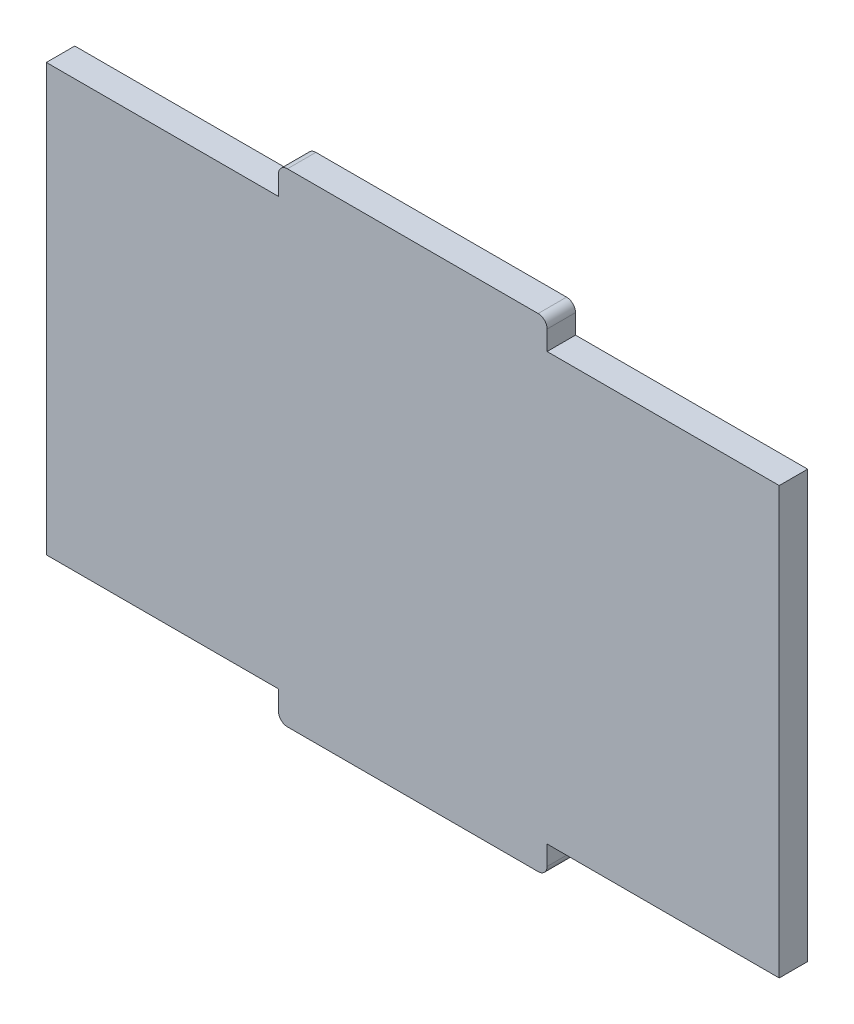
ISO-10303-21;
HEADER;
FILE_DESCRIPTION(('STEP AP214'),'2;1');
FILE_NAME('part.step','',(''),(''),'','','');
FILE_SCHEMA(('AUTOMOTIVE_DESIGN { 1 0 10303 214 1 1 1 1 }'));
ENDSEC;
DATA;
#1=APPLICATION_CONTEXT('core data for automotive mechanical design processes');
#2=APPLICATION_PROTOCOL_DEFINITION('international standard','automotive_design',2000,#1);
#3=PRODUCT_CONTEXT('',#1,'mechanical');
#4=PRODUCT('Part','Part','',(#3));
#5=PRODUCT_RELATED_PRODUCT_CATEGORY('part','',(#4));
#6=PRODUCT_DEFINITION_FORMATION('','',#4);
#7=PRODUCT_DEFINITION_CONTEXT('part definition',#1,'design');
#8=PRODUCT_DEFINITION('design','',#6,#7);
#9=PRODUCT_DEFINITION_SHAPE('','',#8);
#10=(LENGTH_UNIT() NAMED_UNIT(*) SI_UNIT(.MILLI.,.METRE.));
#11=(NAMED_UNIT(*) PLANE_ANGLE_UNIT() SI_UNIT($,.RADIAN.));
#12=(NAMED_UNIT(*) SI_UNIT($,.STERADIAN.) SOLID_ANGLE_UNIT());
#13=UNCERTAINTY_MEASURE_WITH_UNIT(LENGTH_MEASURE(1.E-05),#10,'distance_accuracy_value','');
#14=(GEOMETRIC_REPRESENTATION_CONTEXT(3) GLOBAL_UNCERTAINTY_ASSIGNED_CONTEXT((#13)) GLOBAL_UNIT_ASSIGNED_CONTEXT((#10,
#11,#12)) REPRESENTATION_CONTEXT('',''));
#15=CARTESIAN_POINT('',(0.,0.,0.));
#16=DIRECTION('',(0.,0.,1.));
#17=DIRECTION('',(1.,0.,0.));
#18=AXIS2_PLACEMENT_3D('',#15,#16,#17);
#19=CARTESIAN_POINT('',(-40.925,-23.815,3.175));
#20=DIRECTION('',(-1.,0.,0.));
#21=DIRECTION('',(0.,0.,1.));
#22=AXIS2_PLACEMENT_3D('',#19,#20,#21);
#23=PLANE('',#22);
#24=DIRECTION('',(0.,1.,0.));
#25=VECTOR('',#24,1.);
#26=CARTESIAN_POINT('',(-40.925,-23.815,0.));
#27=LINE('',#26,#25);
#28=CARTESIAN_POINT('',(-40.925,-23.815,0.));
#29=VERTEX_POINT('',#28);
#30=CARTESIAN_POINT('',(-40.925,23.815,0.));
#31=VERTEX_POINT('',#30);
#32=EDGE_CURVE('E220',#29,#31,#27,.T.);
#33=ORIENTED_EDGE('',*,*,#32,.F.);
#34=DIRECTION('',(0.,0.,-1.));
#35=VECTOR('',#34,1.);
#36=CARTESIAN_POINT('',(-40.925,-23.815,3.175));
#37=LINE('',#36,#35);
#38=CARTESIAN_POINT('',(-40.925,-23.815,3.175));
#39=VERTEX_POINT('',#38);
#40=EDGE_CURVE('E181',#39,#29,#37,.T.);
#41=ORIENTED_EDGE('',*,*,#40,.F.);
#42=DIRECTION('',(0.,1.,0.));
#43=VECTOR('',#42,1.);
#44=CARTESIAN_POINT('',(-40.925,-23.815,3.175));
#45=LINE('',#44,#43);
#46=CARTESIAN_POINT('',(-40.925,23.815,3.175));
#47=VERTEX_POINT('',#46);
#48=EDGE_CURVE('E177',#39,#47,#45,.T.);
#49=ORIENTED_EDGE('',*,*,#48,.T.);
#50=DIRECTION('',(0.,0.,-1.));
#51=VECTOR('',#50,1.);
#52=CARTESIAN_POINT('',(-40.925,23.815,3.175));
#53=LINE('',#52,#51);
#54=EDGE_CURVE('E159',#47,#31,#53,.T.);
#55=ORIENTED_EDGE('',*,*,#54,.T.);
#56=EDGE_LOOP('',(#33,#41,#49,#55));
#57=FACE_BOUND('',#56,.T.);
#58=ADVANCED_FACE('F44',(#57),#23,.T.);
#59=CARTESIAN_POINT('',(-40.925,-23.815,3.175));
#60=DIRECTION('',(0.,1.,0.));
#61=DIRECTION('',(-1.,0.,0.));
#62=AXIS2_PLACEMENT_3D('',#59,#60,#61);
#63=PLANE('',#62);
#64=DIRECTION('',(1.,0.,0.));
#65=VECTOR('',#64,1.);
#66=CARTESIAN_POINT('',(-40.925,-23.815,0.));
#67=LINE('',#66,#65);
#68=CARTESIAN_POINT('',(-15.,-23.815,0.));
#69=VERTEX_POINT('',#68);
#70=EDGE_CURVE('E184',#29,#69,#67,.T.);
#71=ORIENTED_EDGE('',*,*,#70,.T.);
#72=DIRECTION('',(0.,0.,-1.));
#73=VECTOR('',#72,1.);
#74=CARTESIAN_POINT('',(-15.,-23.815,3.175));
#75=LINE('',#74,#73);
#76=CARTESIAN_POINT('',(-15.,-23.815,3.175));
#77=VERTEX_POINT('',#76);
#78=EDGE_CURVE('E260',#77,#69,#75,.T.);
#79=ORIENTED_EDGE('',*,*,#78,.F.);
#80=DIRECTION('',(1.,0.,0.));
#81=VECTOR('',#80,1.);
#82=CARTESIAN_POINT('',(-40.925,-23.815,3.175));
#83=LINE('',#82,#81);
#84=EDGE_CURVE('E171',#39,#77,#83,.T.);
#85=ORIENTED_EDGE('',*,*,#84,.F.);
#86=ORIENTED_EDGE('',*,*,#40,.T.);
#87=EDGE_LOOP('',(#71,#79,#85,#86));
#88=FACE_BOUND('',#87,.T.);
#89=ADVANCED_FACE('F341',(#88),#63,.F.);
#90=CARTESIAN_POINT('',(-15.,-26.99,3.175));
#91=DIRECTION('',(-1.,0.,0.));
#92=DIRECTION('',(0.,0.,1.));
#93=AXIS2_PLACEMENT_3D('',#90,#91,#92);
#94=PLANE('',#93);
#95=DIRECTION('',(0.,1.,0.));
#96=VECTOR('',#95,1.);
#97=CARTESIAN_POINT('',(-15.,-26.99,0.));
#98=LINE('',#97,#96);
#99=CARTESIAN_POINT('',(-15.,-25.99,0.));
#100=VERTEX_POINT('',#99);
#101=EDGE_CURVE('E188',#100,#69,#98,.T.);
#102=ORIENTED_EDGE('',*,*,#101,.F.);
#103=DIRECTION('',(0.,0.,-1.));
#104=VECTOR('',#103,1.);
#105=CARTESIAN_POINT('',(-15.,-25.99,3.175));
#106=LINE('',#105,#104);
#107=CARTESIAN_POINT('',(-15.,-25.99,3.175));
#108=VERTEX_POINT('',#107);
#109=EDGE_CURVE('E312',#100,#108,#106,.F.);
#110=ORIENTED_EDGE('',*,*,#109,.T.);
#111=DIRECTION('',(0.,1.,0.));
#112=VECTOR('',#111,1.);
#113=CARTESIAN_POINT('',(-15.,-26.99,3.175));
#114=LINE('',#113,#112);
#115=EDGE_CURVE('E215',#108,#77,#114,.T.);
#116=ORIENTED_EDGE('',*,*,#115,.T.);
#117=ORIENTED_EDGE('',*,*,#78,.T.);
#118=EDGE_LOOP('',(#102,#110,#116,#117));
#119=FACE_BOUND('',#118,.T.);
#120=ADVANCED_FACE('F396',(#119),#94,.T.);
#121=CARTESIAN_POINT('',(-15.,-26.99,3.175));
#122=DIRECTION('',(0.,1.,0.));
#123=DIRECTION('',(0.,0.,1.));
#124=AXIS2_PLACEMENT_3D('',#121,#122,#123);
#125=PLANE('',#124);
#126=DIRECTION('',(1.,0.,0.));
#127=VECTOR('',#126,1.);
#128=CARTESIAN_POINT('',(-15.,-26.99,0.));
#129=LINE('',#128,#127);
#130=CARTESIAN_POINT('',(-14.,-26.99,0.));
#131=VERTEX_POINT('',#130);
#132=CARTESIAN_POINT('',(14.,-26.99,0.));
#133=VERTEX_POINT('',#132);
#134=EDGE_CURVE('E251',#131,#133,#129,.T.);
#135=ORIENTED_EDGE('',*,*,#134,.T.);
#136=DIRECTION('',(0.,0.,-1.));
#137=VECTOR('',#136,1.);
#138=CARTESIAN_POINT('',(14.,-26.99,3.175));
#139=LINE('',#138,#137);
#140=CARTESIAN_POINT('',(14.,-26.99,3.175));
#141=VERTEX_POINT('',#140);
#142=EDGE_CURVE('E299',#133,#141,#139,.F.);
#143=ORIENTED_EDGE('',*,*,#142,.T.);
#144=DIRECTION('',(1.,0.,0.));
#145=VECTOR('',#144,1.);
#146=CARTESIAN_POINT('',(-15.,-26.99,3.175));
#147=LINE('',#146,#145);
#148=CARTESIAN_POINT('',(-14.,-26.99,3.175));
#149=VERTEX_POINT('',#148);
#150=EDGE_CURVE('E212',#149,#141,#147,.T.);
#151=ORIENTED_EDGE('',*,*,#150,.F.);
#152=DIRECTION('',(0.,0.,-1.));
#153=VECTOR('',#152,1.);
#154=CARTESIAN_POINT('',(-14.,-26.99,0.));
#155=LINE('',#154,#153);
#156=EDGE_CURVE('E295',#149,#131,#155,.T.);
#157=ORIENTED_EDGE('',*,*,#156,.T.);
#158=EDGE_LOOP('',(#135,#143,#151,#157));
#159=FACE_BOUND('',#158,.T.);
#160=ADVANCED_FACE('F352',(#159),#125,.F.);
#161=CARTESIAN_POINT('',(15.,-26.99,3.175));
#162=DIRECTION('',(-1.,0.,0.));
#163=DIRECTION('',(0.,0.,1.));
#164=AXIS2_PLACEMENT_3D('',#161,#162,#163);
#165=PLANE('',#164);
#166=DIRECTION('',(0.,1.,0.));
#167=VECTOR('',#166,1.);
#168=CARTESIAN_POINT('',(15.,-26.99,3.175));
#169=LINE('',#168,#167);
#170=CARTESIAN_POINT('',(15.,-25.99,3.175));
#171=VERTEX_POINT('',#170);
#172=CARTESIAN_POINT('',(15.,-23.815,3.175));
#173=VERTEX_POINT('',#172);
#174=EDGE_CURVE('E209',#171,#173,#169,.T.);
#175=ORIENTED_EDGE('',*,*,#174,.F.);
#176=DIRECTION('',(0.,0.,-1.));
#177=VECTOR('',#176,1.);
#178=CARTESIAN_POINT('',(15.,-25.99,3.175));
#179=LINE('',#178,#177);
#180=CARTESIAN_POINT('',(15.,-25.99,0.));
#181=VERTEX_POINT('',#180);
#182=EDGE_CURVE('E259',#171,#181,#179,.T.);
#183=ORIENTED_EDGE('',*,*,#182,.T.);
#184=DIRECTION('',(0.,1.,0.));
#185=VECTOR('',#184,1.);
#186=CARTESIAN_POINT('',(15.,-26.99,0.));
#187=LINE('',#186,#185);
#188=CARTESIAN_POINT('',(15.,-23.815,0.));
#189=VERTEX_POINT('',#188);
#190=EDGE_CURVE('E248',#181,#189,#187,.T.);
#191=ORIENTED_EDGE('',*,*,#190,.T.);
#192=DIRECTION('',(0.,0.,-1.));
#193=VECTOR('',#192,1.);
#194=CARTESIAN_POINT('',(15.,-23.815,3.175));
#195=LINE('',#194,#193);
#196=EDGE_CURVE('E264',#173,#189,#195,.T.);
#197=ORIENTED_EDGE('',*,*,#196,.F.);
#198=EDGE_LOOP('',(#175,#183,#191,#197));
#199=FACE_BOUND('',#198,.T.);
#200=ADVANCED_FACE('F361',(#199),#165,.F.);
#201=CARTESIAN_POINT('',(15.,-23.815,3.175));
#202=DIRECTION('',(0.,1.,0.));
#203=DIRECTION('',(-1.,0.,0.));
#204=AXIS2_PLACEMENT_3D('',#201,#202,#203);
#205=PLANE('',#204);
#206=DIRECTION('',(1.,0.,0.));
#207=VECTOR('',#206,1.);
#208=CARTESIAN_POINT('',(15.,-23.815,0.));
#209=LINE('',#208,#207);
#210=CARTESIAN_POINT('',(40.925,-23.815,0.));
#211=VERTEX_POINT('',#210);
#212=EDGE_CURVE('E245',#189,#211,#209,.T.);
#213=ORIENTED_EDGE('',*,*,#212,.T.);
#214=DIRECTION('',(0.,0.,-1.));
#215=VECTOR('',#214,1.);
#216=CARTESIAN_POINT('',(40.925,-23.815,3.175));
#217=LINE('',#216,#215);
#218=CARTESIAN_POINT('',(40.925,-23.815,3.175));
#219=VERTEX_POINT('',#218);
#220=EDGE_CURVE('E268',#219,#211,#217,.T.);
#221=ORIENTED_EDGE('',*,*,#220,.F.);
#222=DIRECTION('',(1.,0.,0.));
#223=VECTOR('',#222,1.);
#224=CARTESIAN_POINT('',(15.,-23.815,3.175));
#225=LINE('',#224,#223);
#226=EDGE_CURVE('E206',#173,#219,#225,.T.);
#227=ORIENTED_EDGE('',*,*,#226,.F.);
#228=ORIENTED_EDGE('',*,*,#196,.T.);
#229=EDGE_LOOP('',(#213,#221,#227,#228));
#230=FACE_BOUND('',#229,.T.);
#231=ADVANCED_FACE('F369',(#230),#205,.F.);
#232=CARTESIAN_POINT('',(40.925,-23.815,3.175));
#233=DIRECTION('',(-1.,0.,0.));
#234=DIRECTION('',(0.,0.,1.));
#235=AXIS2_PLACEMENT_3D('',#232,#233,#234);
#236=PLANE('',#235);
#237=DIRECTION('',(0.,1.,0.));
#238=VECTOR('',#237,1.);
#239=CARTESIAN_POINT('',(40.925,-23.815,0.));
#240=LINE('',#239,#238);
#241=CARTESIAN_POINT('',(40.925,23.815,0.));
#242=VERTEX_POINT('',#241);
#243=EDGE_CURVE('E241',#211,#242,#240,.T.);
#244=ORIENTED_EDGE('',*,*,#243,.T.);
#245=DIRECTION('',(0.,0.,-1.));
#246=VECTOR('',#245,1.);
#247=CARTESIAN_POINT('',(40.925,23.815,3.175));
#248=LINE('',#247,#246);
#249=CARTESIAN_POINT('',(40.925,23.815,3.175));
#250=VERTEX_POINT('',#249);
#251=EDGE_CURVE('E272',#250,#242,#248,.T.);
#252=ORIENTED_EDGE('',*,*,#251,.F.);
#253=DIRECTION('',(0.,1.,0.));
#254=VECTOR('',#253,1.);
#255=CARTESIAN_POINT('',(40.925,-23.815,3.175));
#256=LINE('',#255,#254);
#257=EDGE_CURVE('E203',#219,#250,#256,.T.);
#258=ORIENTED_EDGE('',*,*,#257,.F.);
#259=ORIENTED_EDGE('',*,*,#220,.T.);
#260=EDGE_LOOP('',(#244,#252,#258,#259));
#261=FACE_BOUND('',#260,.T.);
#262=ADVANCED_FACE('F372',(#261),#236,.F.);
#263=CARTESIAN_POINT('',(15.,23.815,3.175));
#264=DIRECTION('',(0.,1.,0.));
#265=DIRECTION('',(-1.,0.,0.));
#266=AXIS2_PLACEMENT_3D('',#263,#264,#265);
#267=PLANE('',#266);
#268=DIRECTION('',(1.,0.,0.));
#269=VECTOR('',#268,1.);
#270=CARTESIAN_POINT('',(15.,23.815,0.));
#271=LINE('',#270,#269);
#272=CARTESIAN_POINT('',(15.,23.815,0.));
#273=VERTEX_POINT('',#272);
#274=EDGE_CURVE('E237',#273,#242,#271,.T.);
#275=ORIENTED_EDGE('',*,*,#274,.F.);
#276=DIRECTION('',(0.,0.,-1.));
#277=VECTOR('',#276,1.);
#278=CARTESIAN_POINT('',(15.,23.815,3.175));
#279=LINE('',#278,#277);
#280=CARTESIAN_POINT('',(15.,23.815,3.175));
#281=VERTEX_POINT('',#280);
#282=EDGE_CURVE('E275',#281,#273,#279,.T.);
#283=ORIENTED_EDGE('',*,*,#282,.F.);
#284=DIRECTION('',(1.,0.,0.));
#285=VECTOR('',#284,1.);
#286=CARTESIAN_POINT('',(15.,23.815,3.175));
#287=LINE('',#286,#285);
#288=EDGE_CURVE('E199',#281,#250,#287,.T.);
#289=ORIENTED_EDGE('',*,*,#288,.T.);
#290=ORIENTED_EDGE('',*,*,#251,.T.);
#291=EDGE_LOOP('',(#275,#283,#289,#290));
#292=FACE_BOUND('',#291,.T.);
#293=ADVANCED_FACE('F375',(#292),#267,.T.);
#294=CARTESIAN_POINT('',(15.,23.815,3.175));
#295=DIRECTION('',(-1.,0.,0.));
#296=DIRECTION('',(0.,0.,1.));
#297=AXIS2_PLACEMENT_3D('',#294,#295,#296);
#298=PLANE('',#297);
#299=DIRECTION('',(0.,1.,0.));
#300=VECTOR('',#299,1.);
#301=CARTESIAN_POINT('',(15.,23.815,0.));
#302=LINE('',#301,#300);
#303=CARTESIAN_POINT('',(15.,25.99,0.));
#304=VERTEX_POINT('',#303);
#305=EDGE_CURVE('E233',#273,#304,#302,.T.);
#306=ORIENTED_EDGE('',*,*,#305,.T.);
#307=DIRECTION('',(0.,0.,-1.));
#308=VECTOR('',#307,1.);
#309=CARTESIAN_POINT('',(15.,25.99,3.175));
#310=LINE('',#309,#308);
#311=CARTESIAN_POINT('',(15.,25.99,3.175));
#312=VERTEX_POINT('',#311);
#313=EDGE_CURVE('E11',#304,#312,#310,.F.);
#314=ORIENTED_EDGE('',*,*,#313,.T.);
#315=DIRECTION('',(0.,1.,0.));
#316=VECTOR('',#315,1.);
#317=CARTESIAN_POINT('',(15.,23.815,3.175));
#318=LINE('',#317,#316);
#319=EDGE_CURVE('E196',#281,#312,#318,.T.);
#320=ORIENTED_EDGE('',*,*,#319,.F.);
#321=ORIENTED_EDGE('',*,*,#282,.T.);
#322=EDGE_LOOP('',(#306,#314,#320,#321));
#323=FACE_BOUND('',#322,.T.);
#324=ADVANCED_FACE('F381',(#323),#298,.F.);
#325=CARTESIAN_POINT('',(-15.,26.99,3.175));
#326=DIRECTION('',(0.,1.,0.));
#327=DIRECTION('',(0.,0.,1.));
#328=AXIS2_PLACEMENT_3D('',#325,#326,#327);
#329=PLANE('',#328);
#330=DIRECTION('',(1.,0.,0.));
#331=VECTOR('',#330,1.);
#332=CARTESIAN_POINT('',(-15.,26.99,0.));
#333=LINE('',#332,#331);
#334=CARTESIAN_POINT('',(-14.,26.99,0.));
#335=VERTEX_POINT('',#334);
#336=CARTESIAN_POINT('',(14.,26.99,0.));
#337=VERTEX_POINT('',#336);
#338=EDGE_CURVE('E229',#335,#337,#333,.T.);
#339=ORIENTED_EDGE('',*,*,#338,.F.);
#340=DIRECTION('',(0.,0.,-1.));
#341=VECTOR('',#340,1.);
#342=CARTESIAN_POINT('',(-14.,26.99,3.175));
#343=LINE('',#342,#341);
#344=CARTESIAN_POINT('',(-14.,26.99,3.175));
#345=VERTEX_POINT('',#344);
#346=EDGE_CURVE('E53',#335,#345,#343,.F.);
#347=ORIENTED_EDGE('',*,*,#346,.T.);
#348=DIRECTION('',(1.,0.,0.));
#349=VECTOR('',#348,1.);
#350=CARTESIAN_POINT('',(-15.,26.99,3.175));
#351=LINE('',#350,#349);
#352=CARTESIAN_POINT('',(14.,26.99,3.175));
#353=VERTEX_POINT('',#352);
#354=EDGE_CURVE('E193',#345,#353,#351,.T.);
#355=ORIENTED_EDGE('',*,*,#354,.T.);
#356=DIRECTION('',(0.,0.,-1.));
#357=VECTOR('',#356,1.);
#358=CARTESIAN_POINT('',(14.,26.99,0.));
#359=LINE('',#358,#357);
#360=EDGE_CURVE('E319',#353,#337,#359,.T.);
#361=ORIENTED_EDGE('',*,*,#360,.T.);
#362=EDGE_LOOP('',(#339,#347,#355,#361));
#363=FACE_BOUND('',#362,.T.);
#364=ADVANCED_FACE('F326',(#363),#329,.T.);
#365=CARTESIAN_POINT('',(-15.,23.815,3.175));
#366=DIRECTION('',(-1.,0.,0.));
#367=DIRECTION('',(0.,0.,1.));
#368=AXIS2_PLACEMENT_3D('',#365,#366,#367);
#369=PLANE('',#368);
#370=DIRECTION('',(0.,1.,0.));
#371=VECTOR('',#370,1.);
#372=CARTESIAN_POINT('',(-15.,23.815,3.175));
#373=LINE('',#372,#371);
#374=CARTESIAN_POINT('',(-15.,23.815,3.175));
#375=VERTEX_POINT('',#374);
#376=CARTESIAN_POINT('',(-15.,25.99,3.175));
#377=VERTEX_POINT('',#376);
#378=EDGE_CURVE('E178',#375,#377,#373,.T.);
#379=ORIENTED_EDGE('',*,*,#378,.T.);
#380=DIRECTION('',(0.,0.,-1.));
#381=VECTOR('',#380,1.);
#382=CARTESIAN_POINT('',(-15.,25.99,3.175));
#383=LINE('',#382,#381);
#384=CARTESIAN_POINT('',(-15.,25.99,0.));
#385=VERTEX_POINT('',#384);
#386=EDGE_CURVE('E315',#377,#385,#383,.T.);
#387=ORIENTED_EDGE('',*,*,#386,.T.);
#388=DIRECTION('',(0.,1.,0.));
#389=VECTOR('',#388,1.);
#390=CARTESIAN_POINT('',(-15.,23.815,0.));
#391=LINE('',#390,#389);
#392=CARTESIAN_POINT('',(-15.,23.815,0.));
#393=VERTEX_POINT('',#392);
#394=EDGE_CURVE('E225',#393,#385,#391,.T.);
#395=ORIENTED_EDGE('',*,*,#394,.F.);
#396=DIRECTION('',(0.,0.,-1.));
#397=VECTOR('',#396,1.);
#398=CARTESIAN_POINT('',(-15.,23.815,3.175));
#399=LINE('',#398,#397);
#400=EDGE_CURVE('E170',#375,#393,#399,.T.);
#401=ORIENTED_EDGE('',*,*,#400,.F.);
#402=EDGE_LOOP('',(#379,#387,#395,#401));
#403=FACE_BOUND('',#402,.T.);
#404=ADVANCED_FACE('F333',(#403),#369,.T.);
#405=CARTESIAN_POINT('',(-40.925,23.815,3.175));
#406=DIRECTION('',(0.,1.,0.));
#407=DIRECTION('',(-1.,0.,0.));
#408=AXIS2_PLACEMENT_3D('',#405,#406,#407);
#409=PLANE('',#408);
#410=DIRECTION('',(1.,0.,0.));
#411=VECTOR('',#410,1.);
#412=CARTESIAN_POINT('',(-40.925,23.815,0.));
#413=LINE('',#412,#411);
#414=EDGE_CURVE('E164',#31,#393,#413,.T.);
#415=ORIENTED_EDGE('',*,*,#414,.F.);
#416=ORIENTED_EDGE('',*,*,#54,.F.);
#417=DIRECTION('',(1.,0.,0.));
#418=VECTOR('',#417,1.);
#419=CARTESIAN_POINT('',(-40.925,23.815,3.175));
#420=LINE('',#419,#418);
#421=EDGE_CURVE('E162',#47,#375,#420,.T.);
#422=ORIENTED_EDGE('',*,*,#421,.T.);
#423=ORIENTED_EDGE('',*,*,#400,.T.);
#424=EDGE_LOOP('',(#415,#416,#422,#423));
#425=FACE_BOUND('',#424,.T.);
#426=ADVANCED_FACE('F161',(#425),#409,.T.);
#427=CARTESIAN_POINT('',(0.,0.,3.175));
#428=DIRECTION('',(0.,0.,-1.));
#429=DIRECTION('',(-1.,0.,0.));
#430=AXIS2_PLACEMENT_3D('',#427,#428,#429);
#431=PLANE('',#430);
#432=ORIENTED_EDGE('',*,*,#150,.T.);
#433=CARTESIAN_POINT('',(14.,-25.99,3.175));
#434=DIRECTION('',(0.,0.,-1.));
#435=DIRECTION('',(-1.,0.,0.));
#436=AXIS2_PLACEMENT_3D('',#433,#434,#435);
#437=CIRCLE('',#436,1.);
#438=EDGE_CURVE('E309',#141,#171,#437,.F.);
#439=ORIENTED_EDGE('',*,*,#438,.T.);
#440=ORIENTED_EDGE('',*,*,#174,.T.);
#441=ORIENTED_EDGE('',*,*,#226,.T.);
#442=ORIENTED_EDGE('',*,*,#257,.T.);
#443=ORIENTED_EDGE('',*,*,#288,.F.);
#444=ORIENTED_EDGE('',*,*,#319,.T.);
#445=CARTESIAN_POINT('',(14.,25.99,3.175));
#446=DIRECTION('',(0.,0.,-1.));
#447=DIRECTION('',(-1.,0.,0.));
#448=AXIS2_PLACEMENT_3D('',#445,#446,#447);
#449=CIRCLE('',#448,1.);
#450=EDGE_CURVE('E66',#312,#353,#449,.F.);
#451=ORIENTED_EDGE('',*,*,#450,.T.);
#452=ORIENTED_EDGE('',*,*,#354,.F.);
#453=CARTESIAN_POINT('',(-14.,25.99,3.175));
#454=DIRECTION('',(0.,0.,-1.));
#455=DIRECTION('',(-1.,0.,0.));
#456=AXIS2_PLACEMENT_3D('',#453,#454,#455);
#457=CIRCLE('',#456,1.);
#458=EDGE_CURVE('E60',#345,#377,#457,.F.);
#459=ORIENTED_EDGE('',*,*,#458,.T.);
#460=ORIENTED_EDGE('',*,*,#378,.F.);
#461=ORIENTED_EDGE('',*,*,#421,.F.);
#462=ORIENTED_EDGE('',*,*,#48,.F.);
#463=ORIENTED_EDGE('',*,*,#84,.T.);
#464=ORIENTED_EDGE('',*,*,#115,.F.);
#465=CARTESIAN_POINT('',(-14.,-25.99,3.175));
#466=DIRECTION('',(0.,0.,-1.));
#467=DIRECTION('',(-1.,0.,0.));
#468=AXIS2_PLACEMENT_3D('',#465,#466,#467);
#469=CIRCLE('',#468,1.);
#470=EDGE_CURVE('E306',#108,#149,#469,.F.);
#471=ORIENTED_EDGE('',*,*,#470,.T.);
#472=EDGE_LOOP('',(#432,#439,#440,#441,#442,#443,#444,#451,#452,#459,#460,#461,#462,#463,#464,#471));
#473=FACE_BOUND('',#472,.T.);
#474=ADVANCED_FACE('F175',(#473),#431,.F.);
#475=CARTESIAN_POINT('',(0.,0.,0.));
#476=DIRECTION('',(0.,0.,-1.));
#477=DIRECTION('',(-1.,0.,0.));
#478=AXIS2_PLACEMENT_3D('',#475,#476,#477);
#479=PLANE('',#478);
#480=ORIENTED_EDGE('',*,*,#190,.F.);
#481=CARTESIAN_POINT('',(14.,-25.99,0.));
#482=DIRECTION('',(0.,0.,-1.));
#483=DIRECTION('',(-1.,0.,0.));
#484=AXIS2_PLACEMENT_3D('',#481,#482,#483);
#485=CIRCLE('',#484,1.);
#486=EDGE_CURVE('E292',#181,#133,#485,.T.);
#487=ORIENTED_EDGE('',*,*,#486,.T.);
#488=ORIENTED_EDGE('',*,*,#134,.F.);
#489=CARTESIAN_POINT('',(-14.,-25.99,0.));
#490=DIRECTION('',(0.,0.,-1.));
#491=DIRECTION('',(-1.,0.,0.));
#492=AXIS2_PLACEMENT_3D('',#489,#490,#491);
#493=CIRCLE('',#492,1.);
#494=EDGE_CURVE('E289',#131,#100,#493,.T.);
#495=ORIENTED_EDGE('',*,*,#494,.T.);
#496=ORIENTED_EDGE('',*,*,#101,.T.);
#497=ORIENTED_EDGE('',*,*,#70,.F.);
#498=ORIENTED_EDGE('',*,*,#32,.T.);
#499=ORIENTED_EDGE('',*,*,#414,.T.);
#500=ORIENTED_EDGE('',*,*,#394,.T.);
#501=CARTESIAN_POINT('',(-14.,25.99,0.));
#502=DIRECTION('',(0.,0.,-1.));
#503=DIRECTION('',(-1.,0.,0.));
#504=AXIS2_PLACEMENT_3D('',#501,#502,#503);
#505=CIRCLE('',#504,1.);
#506=EDGE_CURVE('E286',#385,#335,#505,.T.);
#507=ORIENTED_EDGE('',*,*,#506,.T.);
#508=ORIENTED_EDGE('',*,*,#338,.T.);
#509=CARTESIAN_POINT('',(14.,25.99,0.));
#510=DIRECTION('',(0.,0.,-1.));
#511=DIRECTION('',(-1.,0.,0.));
#512=AXIS2_PLACEMENT_3D('',#509,#510,#511);
#513=CIRCLE('',#512,1.);
#514=EDGE_CURVE('E283',#337,#304,#513,.T.);
#515=ORIENTED_EDGE('',*,*,#514,.T.);
#516=ORIENTED_EDGE('',*,*,#305,.F.);
#517=ORIENTED_EDGE('',*,*,#274,.T.);
#518=ORIENTED_EDGE('',*,*,#243,.F.);
#519=ORIENTED_EDGE('',*,*,#212,.F.);
#520=EDGE_LOOP('',(#480,#487,#488,#495,#496,#497,#498,#499,#500,#507,#508,#515,#516,#517,#518,#519));
#521=FACE_BOUND('',#520,.T.);
#522=ADVANCED_FACE('F336',(#521),#479,.T.);
#523=CARTESIAN_POINT('',(14.,-25.99,3.175));
#524=DIRECTION('',(0.,0.,-1.));
#525=DIRECTION('',(-1.,0.,0.));
#526=AXIS2_PLACEMENT_3D('',#523,#524,#525);
#527=CYLINDRICAL_SURFACE('',#526,1.);
#528=ORIENTED_EDGE('',*,*,#438,.F.);
#529=ORIENTED_EDGE('',*,*,#142,.F.);
#530=ORIENTED_EDGE('',*,*,#486,.F.);
#531=ORIENTED_EDGE('',*,*,#182,.F.);
#532=EDGE_LOOP('',(#528,#529,#530,#531));
#533=FACE_BOUND('',#532,.T.);
#534=ADVANCED_FACE('F358',(#533),#527,.T.);
#535=CARTESIAN_POINT('',(-14.,-25.99,3.175));
#536=DIRECTION('',(0.,0.,1.));
#537=DIRECTION('',(1.,0.,0.));
#538=AXIS2_PLACEMENT_3D('',#535,#536,#537);
#539=CYLINDRICAL_SURFACE('',#538,1.);
#540=ORIENTED_EDGE('',*,*,#470,.F.);
#541=ORIENTED_EDGE('',*,*,#109,.F.);
#542=ORIENTED_EDGE('',*,*,#494,.F.);
#543=ORIENTED_EDGE('',*,*,#156,.F.);
#544=EDGE_LOOP('',(#540,#541,#542,#543));
#545=FACE_BOUND('',#544,.T.);
#546=ADVANCED_FACE('F349',(#545),#539,.T.);
#547=CARTESIAN_POINT('',(-14.,25.99,3.175));
#548=DIRECTION('',(0.,0.,-1.));
#549=DIRECTION('',(-1.,0.,0.));
#550=AXIS2_PLACEMENT_3D('',#547,#548,#549);
#551=CYLINDRICAL_SURFACE('',#550,1.);
#552=ORIENTED_EDGE('',*,*,#458,.F.);
#553=ORIENTED_EDGE('',*,*,#346,.F.);
#554=ORIENTED_EDGE('',*,*,#506,.F.);
#555=ORIENTED_EDGE('',*,*,#386,.F.);
#556=EDGE_LOOP('',(#552,#553,#554,#555));
#557=FACE_BOUND('',#556,.T.);
#558=ADVANCED_FACE('F330',(#557),#551,.T.);
#559=CARTESIAN_POINT('',(14.,25.99,3.175));
#560=DIRECTION('',(0.,0.,1.));
#561=DIRECTION('',(1.,0.,0.));
#562=AXIS2_PLACEMENT_3D('',#559,#560,#561);
#563=CYLINDRICAL_SURFACE('',#562,1.);
#564=ORIENTED_EDGE('',*,*,#450,.F.);
#565=ORIENTED_EDGE('',*,*,#313,.F.);
#566=ORIENTED_EDGE('',*,*,#514,.F.);
#567=ORIENTED_EDGE('',*,*,#360,.F.);
#568=EDGE_LOOP('',(#564,#565,#566,#567));
#569=FACE_BOUND('',#568,.T.);
#570=ADVANCED_FACE('F46',(#569),#563,.T.);
#571=CLOSED_SHELL('',(#58,#89,#120,#160,#200,#231,#262,#293,#324,#364,#404,#426,#474,#522,#534,
#546,#558,#570));
#572=MANIFOLD_SOLID_BREP('B2',#571);
#573=ADVANCED_BREP_SHAPE_REPRESENTATION('',(#18,#572),#14);
#574=SHAPE_DEFINITION_REPRESENTATION(#9,#573);
ENDSEC;
END-ISO-10303-21;
